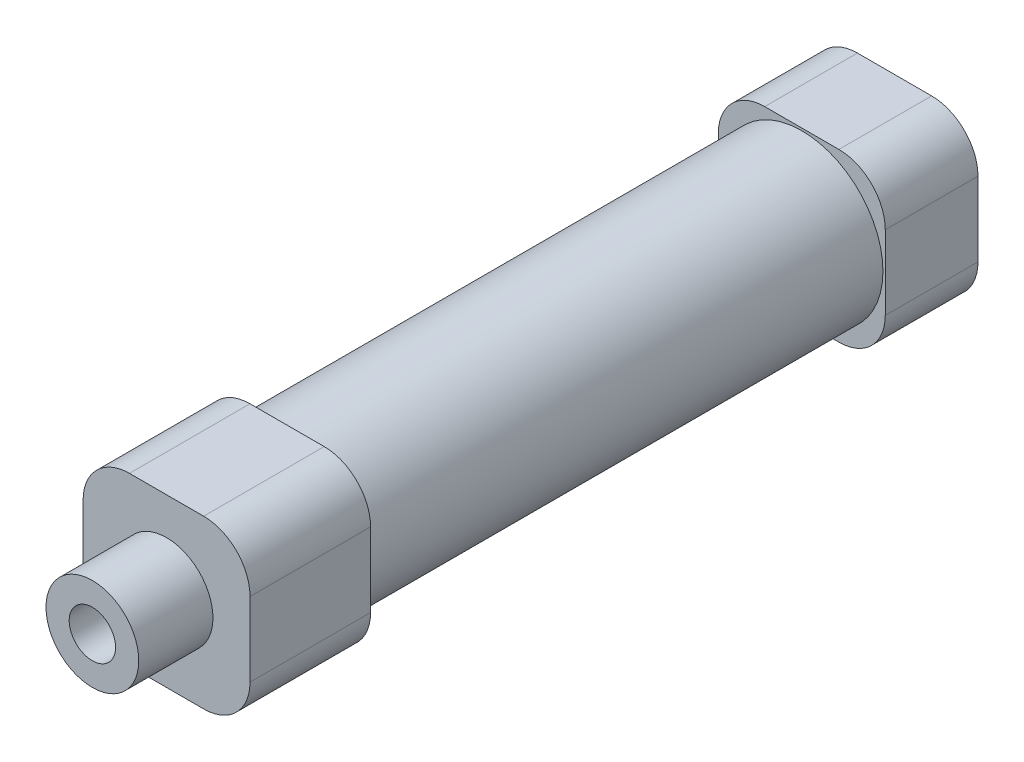
ISO-10303-21;
HEADER;
FILE_DESCRIPTION(('STEP AP214'),'2;1');
FILE_NAME('part.step','',(''),(''),'','','');
FILE_SCHEMA(('AUTOMOTIVE_DESIGN { 1 0 10303 214 1 1 1 1 }'));
ENDSEC;
DATA;
#1=APPLICATION_CONTEXT('core data for automotive mechanical design processes');
#2=APPLICATION_PROTOCOL_DEFINITION('international standard','automotive_design',2000,#1);
#3=PRODUCT_CONTEXT('',#1,'mechanical');
#4=PRODUCT('Part','Part','',(#3));
#5=PRODUCT_RELATED_PRODUCT_CATEGORY('part','',(#4));
#6=PRODUCT_DEFINITION_FORMATION('','',#4);
#7=PRODUCT_DEFINITION_CONTEXT('part definition',#1,'design');
#8=PRODUCT_DEFINITION('design','',#6,#7);
#9=PRODUCT_DEFINITION_SHAPE('','',#8);
#10=(LENGTH_UNIT() NAMED_UNIT(*) SI_UNIT(.MILLI.,.METRE.));
#11=(NAMED_UNIT(*) PLANE_ANGLE_UNIT() SI_UNIT($,.RADIAN.));
#12=(NAMED_UNIT(*) SI_UNIT($,.STERADIAN.) SOLID_ANGLE_UNIT());
#13=UNCERTAINTY_MEASURE_WITH_UNIT(LENGTH_MEASURE(1.E-05),#10,'distance_accuracy_value','');
#14=(GEOMETRIC_REPRESENTATION_CONTEXT(3) GLOBAL_UNCERTAINTY_ASSIGNED_CONTEXT((#13)) GLOBAL_UNIT_ASSIGNED_CONTEXT((#10,
#11,#12)) REPRESENTATION_CONTEXT('',''));
#15=CARTESIAN_POINT('',(0.,0.,0.));
#16=DIRECTION('',(0.,0.,1.));
#17=DIRECTION('',(1.,0.,0.));
#18=AXIS2_PLACEMENT_3D('',#15,#16,#17);
#19=CARTESIAN_POINT('',(0.,0.,78.5));
#20=DIRECTION('',(0.,0.,-1.));
#21=DIRECTION('',(-1.,0.,0.));
#22=AXIS2_PLACEMENT_3D('',#19,#20,#21);
#23=PLANE('',#22);
#24=DIRECTION('',(-1.,0.,0.));
#25=VECTOR('',#24,1.);
#26=CARTESIAN_POINT('',(-9.,9.,78.5));
#27=LINE('',#26,#25);
#28=CARTESIAN_POINT('',(4.,9.,78.5));
#29=VERTEX_POINT('',#28);
#30=CARTESIAN_POINT('',(-4.,9.,78.5));
#31=VERTEX_POINT('',#30);
#32=EDGE_CURVE('E193',#29,#31,#27,.T.);
#33=ORIENTED_EDGE('',*,*,#32,.T.);
#34=CARTESIAN_POINT('',(-4.,4.,78.5));
#35=DIRECTION('',(0.,0.,-1.));
#36=DIRECTION('',(-1.,0.,0.));
#37=AXIS2_PLACEMENT_3D('',#34,#35,#36);
#38=CIRCLE('',#37,5.);
#39=CARTESIAN_POINT('',(-9.,4.,78.5));
#40=VERTEX_POINT('',#39);
#41=EDGE_CURVE('E301',#31,#40,#38,.F.);
#42=ORIENTED_EDGE('',*,*,#41,.T.);
#43=DIRECTION('',(0.,-1.,0.));
#44=VECTOR('',#43,1.);
#45=CARTESIAN_POINT('',(-9.,-9.,78.5));
#46=LINE('',#45,#44);
#47=CARTESIAN_POINT('',(-9.,-4.,78.5));
#48=VERTEX_POINT('',#47);
#49=EDGE_CURVE('E197',#40,#48,#46,.T.);
#50=ORIENTED_EDGE('',*,*,#49,.T.);
#51=CARTESIAN_POINT('',(-4.,-4.,78.5));
#52=DIRECTION('',(0.,0.,-1.));
#53=DIRECTION('',(-1.,0.,0.));
#54=AXIS2_PLACEMENT_3D('',#51,#52,#53);
#55=CIRCLE('',#54,5.);
#56=CARTESIAN_POINT('',(-4.,-9.,78.5));
#57=VERTEX_POINT('',#56);
#58=EDGE_CURVE('E299',#48,#57,#55,.F.);
#59=ORIENTED_EDGE('',*,*,#58,.T.);
#60=DIRECTION('',(1.,0.,0.));
#61=VECTOR('',#60,1.);
#62=CARTESIAN_POINT('',(-9.,-9.,78.5));
#63=LINE('',#62,#61);
#64=CARTESIAN_POINT('',(4.,-9.,78.5));
#65=VERTEX_POINT('',#64);
#66=EDGE_CURVE('E200',#57,#65,#63,.T.);
#67=ORIENTED_EDGE('',*,*,#66,.T.);
#68=CARTESIAN_POINT('',(4.,-4.,78.5));
#69=DIRECTION('',(0.,0.,-1.));
#70=DIRECTION('',(-1.,0.,0.));
#71=AXIS2_PLACEMENT_3D('',#68,#69,#70);
#72=CIRCLE('',#71,5.);
#73=CARTESIAN_POINT('',(9.,-4.,78.5));
#74=VERTEX_POINT('',#73);
#75=EDGE_CURVE('E297',#65,#74,#72,.F.);
#76=ORIENTED_EDGE('',*,*,#75,.T.);
#77=DIRECTION('',(0.,1.,0.));
#78=VECTOR('',#77,1.);
#79=CARTESIAN_POINT('',(9.,-9.,78.5));
#80=LINE('',#79,#78);
#81=CARTESIAN_POINT('',(9.,4.,78.5));
#82=VERTEX_POINT('',#81);
#83=EDGE_CURVE('E190',#74,#82,#80,.T.);
#84=ORIENTED_EDGE('',*,*,#83,.T.);
#85=CARTESIAN_POINT('',(4.,4.,78.5));
#86=DIRECTION('',(0.,0.,-1.));
#87=DIRECTION('',(-1.,0.,0.));
#88=AXIS2_PLACEMENT_3D('',#85,#86,#87);
#89=CIRCLE('',#88,5.);
#90=EDGE_CURVE('E295',#82,#29,#89,.F.);
#91=ORIENTED_EDGE('',*,*,#90,.T.);
#92=EDGE_LOOP('',(#33,#42,#50,#59,#67,#76,#84,#91));
#93=FACE_BOUND('',#92,.T.);
#94=CARTESIAN_POINT('',(0.,0.,78.5));
#95=DIRECTION('',(0.,0.,-1.));
#96=DIRECTION('',(-1.,0.,0.));
#97=AXIS2_PLACEMENT_3D('',#94,#95,#96);
#98=CIRCLE('',#97,5.);
#99=CARTESIAN_POINT('',(-5.,0.,78.5));
#100=VERTEX_POINT('',#99);
#101=EDGE_CURVE('E233',#100,#100,#98,.F.);
#102=ORIENTED_EDGE('',*,*,#101,.F.);
#103=EDGE_LOOP('',(#102));
#104=FACE_BOUND('',#103,.T.);
#105=ADVANCED_FACE('F40',(#93,#104),#23,.F.);
#106=CARTESIAN_POINT('',(0.,0.,10.));
#107=DIRECTION('',(0.,0.,1.));
#108=DIRECTION('',(1.,0.,0.));
#109=AXIS2_PLACEMENT_3D('',#106,#107,#108);
#110=PLANE('',#109);
#111=DIRECTION('',(-1.,0.,0.));
#112=VECTOR('',#111,1.);
#113=CARTESIAN_POINT('',(-9.,9.,10.));
#114=LINE('',#113,#112);
#115=CARTESIAN_POINT('',(4.,9.,10.));
#116=VERTEX_POINT('',#115);
#117=CARTESIAN_POINT('',(-4.,9.,10.));
#118=VERTEX_POINT('',#117);
#119=EDGE_CURVE('E223',#116,#118,#114,.T.);
#120=ORIENTED_EDGE('',*,*,#119,.T.);
#121=CARTESIAN_POINT('',(-4.,4.,10.));
#122=DIRECTION('',(0.,0.,1.));
#123=DIRECTION('',(1.,0.,0.));
#124=AXIS2_PLACEMENT_3D('',#121,#122,#123);
#125=CIRCLE('',#124,5.);
#126=CARTESIAN_POINT('',(-9.,4.,10.));
#127=VERTEX_POINT('',#126);
#128=EDGE_CURVE('E270',#118,#127,#125,.T.);
#129=ORIENTED_EDGE('',*,*,#128,.T.);
#130=DIRECTION('',(0.,-1.,0.));
#131=VECTOR('',#130,1.);
#132=CARTESIAN_POINT('',(-9.,9.,10.));
#133=LINE('',#132,#131);
#134=CARTESIAN_POINT('',(-9.,-4.,10.));
#135=VERTEX_POINT('',#134);
#136=EDGE_CURVE('E227',#127,#135,#133,.T.);
#137=ORIENTED_EDGE('',*,*,#136,.T.);
#138=CARTESIAN_POINT('',(-4.,-4.,10.));
#139=DIRECTION('',(0.,0.,1.));
#140=DIRECTION('',(1.,0.,0.));
#141=AXIS2_PLACEMENT_3D('',#138,#139,#140);
#142=CIRCLE('',#141,5.);
#143=CARTESIAN_POINT('',(-4.,-9.,10.));
#144=VERTEX_POINT('',#143);
#145=EDGE_CURVE('E268',#135,#144,#142,.T.);
#146=ORIENTED_EDGE('',*,*,#145,.T.);
#147=DIRECTION('',(1.,0.,0.));
#148=VECTOR('',#147,1.);
#149=CARTESIAN_POINT('',(-9.,-9.,10.));
#150=LINE('',#149,#148);
#151=CARTESIAN_POINT('',(4.,-9.,10.));
#152=VERTEX_POINT('',#151);
#153=EDGE_CURVE('E230',#144,#152,#150,.T.);
#154=ORIENTED_EDGE('',*,*,#153,.T.);
#155=CARTESIAN_POINT('',(4.,-4.,10.));
#156=DIRECTION('',(0.,0.,1.));
#157=DIRECTION('',(1.,0.,0.));
#158=AXIS2_PLACEMENT_3D('',#155,#156,#157);
#159=CIRCLE('',#158,5.);
#160=CARTESIAN_POINT('',(9.,-4.,10.));
#161=VERTEX_POINT('',#160);
#162=EDGE_CURVE('E266',#152,#161,#159,.T.);
#163=ORIENTED_EDGE('',*,*,#162,.T.);
#164=DIRECTION('',(0.,1.,0.));
#165=VECTOR('',#164,1.);
#166=CARTESIAN_POINT('',(9.,9.,10.));
#167=LINE('',#166,#165);
#168=CARTESIAN_POINT('',(9.,4.,10.));
#169=VERTEX_POINT('',#168);
#170=EDGE_CURVE('E220',#161,#169,#167,.T.);
#171=ORIENTED_EDGE('',*,*,#170,.T.);
#172=CARTESIAN_POINT('',(4.,4.,10.));
#173=DIRECTION('',(0.,0.,1.));
#174=DIRECTION('',(1.,0.,0.));
#175=AXIS2_PLACEMENT_3D('',#172,#173,#174);
#176=CIRCLE('',#175,5.);
#177=EDGE_CURVE('E264',#169,#116,#176,.T.);
#178=ORIENTED_EDGE('',*,*,#177,.T.);
#179=EDGE_LOOP('',(#120,#129,#137,#146,#154,#163,#171,#178));
#180=FACE_BOUND('',#179,.T.);
#181=CARTESIAN_POINT('',(0.,0.,10.));
#182=DIRECTION('',(0.,0.,1.));
#183=DIRECTION('',(1.,0.,0.));
#184=AXIS2_PLACEMENT_3D('',#181,#182,#183);
#185=CIRCLE('',#184,8.75);
#186=CARTESIAN_POINT('',(8.74999999999999,0.,10.));
#187=VERTEX_POINT('',#186);
#188=EDGE_CURVE('E203',#187,#187,#185,.T.);
#189=ORIENTED_EDGE('',*,*,#188,.F.);
#190=EDGE_LOOP('',(#189));
#191=FACE_BOUND('',#190,.T.);
#192=ADVANCED_FACE('F371',(#180,#191),#110,.T.);
#193=CARTESIAN_POINT('',(9.,9.,10.));
#194=DIRECTION('',(-1.,0.,0.));
#195=DIRECTION('',(0.,-1.,0.));
#196=AXIS2_PLACEMENT_3D('',#193,#194,#195);
#197=PLANE('',#196);
#198=ORIENTED_EDGE('',*,*,#170,.F.);
#199=DIRECTION('',(0.,0.,-1.));
#200=VECTOR('',#199,1.);
#201=CARTESIAN_POINT('',(9.,-4.,10.));
#202=LINE('',#201,#200);
#203=CARTESIAN_POINT('',(9.,-4.,0.));
#204=VERTEX_POINT('',#203);
#205=EDGE_CURVE('E310',#161,#204,#202,.T.);
#206=ORIENTED_EDGE('',*,*,#205,.T.);
#207=DIRECTION('',(0.,1.,0.));
#208=VECTOR('',#207,1.);
#209=CARTESIAN_POINT('',(9.,9.,0.));
#210=LINE('',#209,#208);
#211=CARTESIAN_POINT('',(9.,4.,0.));
#212=VERTEX_POINT('',#211);
#213=EDGE_CURVE('E217',#204,#212,#210,.T.);
#214=ORIENTED_EDGE('',*,*,#213,.T.);
#215=DIRECTION('',(0.,0.,-1.));
#216=VECTOR('',#215,1.);
#217=CARTESIAN_POINT('',(9.,4.,10.));
#218=LINE('',#217,#216);
#219=EDGE_CURVE('E308',#212,#169,#218,.F.);
#220=ORIENTED_EDGE('',*,*,#219,.T.);
#221=EDGE_LOOP('',(#198,#206,#214,#220));
#222=FACE_BOUND('',#221,.T.);
#223=ADVANCED_FACE('F376',(#222),#197,.F.);
#224=CARTESIAN_POINT('',(-9.,9.,10.));
#225=DIRECTION('',(0.,-1.,0.));
#226=DIRECTION('',(0.,0.,-1.));
#227=AXIS2_PLACEMENT_3D('',#224,#225,#226);
#228=PLANE('',#227);
#229=DIRECTION('',(-1.,0.,0.));
#230=VECTOR('',#229,1.);
#231=CARTESIAN_POINT('',(-9.,9.,0.));
#232=LINE('',#231,#230);
#233=CARTESIAN_POINT('',(4.,9.,0.));
#234=VERTEX_POINT('',#233);
#235=CARTESIAN_POINT('',(-4.,9.,0.));
#236=VERTEX_POINT('',#235);
#237=EDGE_CURVE('E236',#234,#236,#232,.T.);
#238=ORIENTED_EDGE('',*,*,#237,.T.);
#239=DIRECTION('',(0.,0.,-1.));
#240=VECTOR('',#239,1.);
#241=CARTESIAN_POINT('',(-4.,9.,10.));
#242=LINE('',#241,#240);
#243=EDGE_CURVE('E262',#236,#118,#242,.F.);
#244=ORIENTED_EDGE('',*,*,#243,.T.);
#245=ORIENTED_EDGE('',*,*,#119,.F.);
#246=DIRECTION('',(0.,0.,-1.));
#247=VECTOR('',#246,1.);
#248=CARTESIAN_POINT('',(4.,9.,10.));
#249=LINE('',#248,#247);
#250=EDGE_CURVE('E259',#116,#234,#249,.T.);
#251=ORIENTED_EDGE('',*,*,#250,.T.);
#252=EDGE_LOOP('',(#238,#244,#245,#251));
#253=FACE_BOUND('',#252,.T.);
#254=ADVANCED_FACE('F409',(#253),#228,.F.);
#255=CARTESIAN_POINT('',(-9.,9.,10.));
#256=DIRECTION('',(1.,0.,0.));
#257=DIRECTION('',(0.,1.,0.));
#258=AXIS2_PLACEMENT_3D('',#255,#256,#257);
#259=PLANE('',#258);
#260=ORIENTED_EDGE('',*,*,#136,.F.);
#261=DIRECTION('',(0.,0.,-1.));
#262=VECTOR('',#261,1.);
#263=CARTESIAN_POINT('',(-9.,4.,10.));
#264=LINE('',#263,#262);
#265=CARTESIAN_POINT('',(-9.,4.,0.));
#266=VERTEX_POINT('',#265);
#267=EDGE_CURVE('E248',#127,#266,#264,.T.);
#268=ORIENTED_EDGE('',*,*,#267,.T.);
#269=DIRECTION('',(0.,-1.,0.));
#270=VECTOR('',#269,1.);
#271=CARTESIAN_POINT('',(-9.,9.,0.));
#272=LINE('',#271,#270);
#273=CARTESIAN_POINT('',(-9.,-4.,0.));
#274=VERTEX_POINT('',#273);
#275=EDGE_CURVE('E239',#266,#274,#272,.T.);
#276=ORIENTED_EDGE('',*,*,#275,.T.);
#277=DIRECTION('',(0.,0.,-1.));
#278=VECTOR('',#277,1.);
#279=CARTESIAN_POINT('',(-9.,-4.,10.));
#280=LINE('',#279,#278);
#281=EDGE_CURVE('E246',#274,#135,#280,.F.);
#282=ORIENTED_EDGE('',*,*,#281,.T.);
#283=EDGE_LOOP('',(#260,#268,#276,#282));
#284=FACE_BOUND('',#283,.T.);
#285=ADVANCED_FACE('F405',(#284),#259,.F.);
#286=CARTESIAN_POINT('',(-9.,-9.,10.));
#287=DIRECTION('',(0.,1.,0.));
#288=DIRECTION('',(0.,0.,1.));
#289=AXIS2_PLACEMENT_3D('',#286,#287,#288);
#290=PLANE('',#289);
#291=CARTESIAN_POINT('',(0.,-9.,5.25));
#292=DIRECTION('',(0.,-1.,0.));
#293=DIRECTION('',(0.,0.,-1.));
#294=AXIS2_PLACEMENT_3D('',#291,#292,#293);
#295=CIRCLE('',#294,2.5);
#296=CARTESIAN_POINT('',(0.,-9.,2.75));
#297=VERTEX_POINT('',#296);
#298=EDGE_CURVE('E178',#297,#297,#295,.T.);
#299=ORIENTED_EDGE('',*,*,#298,.F.);
#300=EDGE_LOOP('',(#299));
#301=FACE_BOUND('',#300,.T.);
#302=ORIENTED_EDGE('',*,*,#153,.F.);
#303=DIRECTION('',(0.,0.,-1.));
#304=VECTOR('',#303,1.);
#305=CARTESIAN_POINT('',(-4.,-9.,10.));
#306=LINE('',#305,#304);
#307=CARTESIAN_POINT('',(-4.,-9.,0.));
#308=VERTEX_POINT('',#307);
#309=EDGE_CURVE('E274',#144,#308,#306,.T.);
#310=ORIENTED_EDGE('',*,*,#309,.T.);
#311=DIRECTION('',(1.,0.,0.));
#312=VECTOR('',#311,1.);
#313=CARTESIAN_POINT('',(-9.,-9.,0.));
#314=LINE('',#313,#312);
#315=CARTESIAN_POINT('',(4.,-9.,0.));
#316=VERTEX_POINT('',#315);
#317=EDGE_CURVE('E224',#308,#316,#314,.T.);
#318=ORIENTED_EDGE('',*,*,#317,.T.);
#319=DIRECTION('',(0.,0.,-1.));
#320=VECTOR('',#319,1.);
#321=CARTESIAN_POINT('',(4.,-9.,10.));
#322=LINE('',#321,#320);
#323=EDGE_CURVE('E272',#316,#152,#322,.F.);
#324=ORIENTED_EDGE('',*,*,#323,.T.);
#325=EDGE_LOOP('',(#302,#310,#318,#324));
#326=FACE_BOUND('',#325,.T.);
#327=ADVANCED_FACE('F401',(#301,#326),#290,.F.);
#328=CARTESIAN_POINT('',(0.,0.,0.));
#329=DIRECTION('',(0.,0.,1.));
#330=DIRECTION('',(1.,0.,0.));
#331=AXIS2_PLACEMENT_3D('',#328,#329,#330);
#332=PLANE('',#331);
#333=ORIENTED_EDGE('',*,*,#275,.F.);
#334=CARTESIAN_POINT('',(-4.,4.,0.));
#335=DIRECTION('',(0.,0.,1.));
#336=DIRECTION('',(1.,0.,0.));
#337=AXIS2_PLACEMENT_3D('',#334,#335,#336);
#338=CIRCLE('',#337,5.);
#339=EDGE_CURVE('E257',#266,#236,#338,.F.);
#340=ORIENTED_EDGE('',*,*,#339,.T.);
#341=ORIENTED_EDGE('',*,*,#237,.F.);
#342=CARTESIAN_POINT('',(4.,4.,0.));
#343=DIRECTION('',(0.,0.,1.));
#344=DIRECTION('',(1.,0.,0.));
#345=AXIS2_PLACEMENT_3D('',#342,#343,#344);
#346=CIRCLE('',#345,5.);
#347=EDGE_CURVE('E251',#234,#212,#346,.F.);
#348=ORIENTED_EDGE('',*,*,#347,.T.);
#349=ORIENTED_EDGE('',*,*,#213,.F.);
#350=CARTESIAN_POINT('',(4.,-4.,0.));
#351=DIRECTION('',(0.,0.,1.));
#352=DIRECTION('',(1.,0.,0.));
#353=AXIS2_PLACEMENT_3D('',#350,#351,#352);
#354=CIRCLE('',#353,5.);
#355=EDGE_CURVE('E253',#204,#316,#354,.F.);
#356=ORIENTED_EDGE('',*,*,#355,.T.);
#357=ORIENTED_EDGE('',*,*,#317,.F.);
#358=CARTESIAN_POINT('',(-4.,-4.,0.));
#359=DIRECTION('',(0.,0.,1.));
#360=DIRECTION('',(1.,0.,0.));
#361=AXIS2_PLACEMENT_3D('',#358,#359,#360);
#362=CIRCLE('',#361,5.);
#363=EDGE_CURVE('E255',#308,#274,#362,.F.);
#364=ORIENTED_EDGE('',*,*,#363,.T.);
#365=EDGE_LOOP('',(#333,#340,#341,#348,#349,#356,#357,#364));
#366=FACE_BOUND('',#365,.T.);
#367=ADVANCED_FACE('F396',(#366),#332,.F.);
#368=CARTESIAN_POINT('',(0.,0.,65.5));
#369=DIRECTION('',(0.,0.,-1.));
#370=DIRECTION('',(-1.,0.,0.));
#371=AXIS2_PLACEMENT_3D('',#368,#369,#370);
#372=CYLINDRICAL_SURFACE('',#371,8.75);
#373=CARTESIAN_POINT('',(0.,0.,65.5));
#374=DIRECTION('',(0.,0.,1.));
#375=DIRECTION('',(1.,0.,0.));
#376=AXIS2_PLACEMENT_3D('',#373,#374,#375);
#377=CIRCLE('',#376,8.75);
#378=CARTESIAN_POINT('',(8.74999999999999,0.,65.5));
#379=VERTEX_POINT('',#378);
#380=EDGE_CURVE('E214',#379,#379,#377,.T.);
#381=ORIENTED_EDGE('',*,*,#380,.F.);
#382=EDGE_LOOP('',(#381));
#383=FACE_BOUND('',#382,.T.);
#384=ORIENTED_EDGE('',*,*,#188,.T.);
#385=EDGE_LOOP('',(#384));
#386=FACE_BOUND('',#385,.T.);
#387=ADVANCED_FACE('F385',(#383,#386),#372,.T.);
#388=CARTESIAN_POINT('',(0.,0.,65.5));
#389=DIRECTION('',(0.,0.,-1.));
#390=DIRECTION('',(-1.,0.,0.));
#391=AXIS2_PLACEMENT_3D('',#388,#389,#390);
#392=PLANE('',#391);
#393=DIRECTION('',(0.,-1.,0.));
#394=VECTOR('',#393,1.);
#395=CARTESIAN_POINT('',(-9.,-9.,65.5));
#396=LINE('',#395,#394);
#397=CARTESIAN_POINT('',(-9.,4.,65.5));
#398=VERTEX_POINT('',#397);
#399=CARTESIAN_POINT('',(-9.,-4.,65.5));
#400=VERTEX_POINT('',#399);
#401=EDGE_CURVE('E209',#398,#400,#396,.T.);
#402=ORIENTED_EDGE('',*,*,#401,.F.);
#403=CARTESIAN_POINT('',(-4.,4.,65.5));
#404=DIRECTION('',(0.,0.,-1.));
#405=DIRECTION('',(-1.,0.,0.));
#406=AXIS2_PLACEMENT_3D('',#403,#404,#405);
#407=CIRCLE('',#406,5.);
#408=CARTESIAN_POINT('',(-4.,9.,65.5));
#409=VERTEX_POINT('',#408);
#410=EDGE_CURVE('E288',#398,#409,#407,.T.);
#411=ORIENTED_EDGE('',*,*,#410,.T.);
#412=DIRECTION('',(-1.,0.,0.));
#413=VECTOR('',#412,1.);
#414=CARTESIAN_POINT('',(-9.,9.,65.5));
#415=LINE('',#414,#413);
#416=CARTESIAN_POINT('',(4.,9.,65.5));
#417=VERTEX_POINT('',#416);
#418=EDGE_CURVE('E206',#417,#409,#415,.T.);
#419=ORIENTED_EDGE('',*,*,#418,.F.);
#420=CARTESIAN_POINT('',(4.,4.,65.5));
#421=DIRECTION('',(0.,0.,-1.));
#422=DIRECTION('',(-1.,0.,0.));
#423=AXIS2_PLACEMENT_3D('',#420,#421,#422);
#424=CIRCLE('',#423,5.);
#425=CARTESIAN_POINT('',(9.,4.,65.5));
#426=VERTEX_POINT('',#425);
#427=EDGE_CURVE('E282',#417,#426,#424,.T.);
#428=ORIENTED_EDGE('',*,*,#427,.T.);
#429=DIRECTION('',(0.,1.,0.));
#430=VECTOR('',#429,1.);
#431=CARTESIAN_POINT('',(9.,-9.,65.5));
#432=LINE('',#431,#430);
#433=CARTESIAN_POINT('',(9.,-4.,65.5));
#434=VERTEX_POINT('',#433);
#435=EDGE_CURVE('E189',#434,#426,#432,.T.);
#436=ORIENTED_EDGE('',*,*,#435,.F.);
#437=CARTESIAN_POINT('',(4.,-4.,65.5));
#438=DIRECTION('',(0.,0.,-1.));
#439=DIRECTION('',(-1.,0.,0.));
#440=AXIS2_PLACEMENT_3D('',#437,#438,#439);
#441=CIRCLE('',#440,5.);
#442=CARTESIAN_POINT('',(4.,-9.,65.5));
#443=VERTEX_POINT('',#442);
#444=EDGE_CURVE('E284',#434,#443,#441,.T.);
#445=ORIENTED_EDGE('',*,*,#444,.T.);
#446=DIRECTION('',(1.,0.,0.));
#447=VECTOR('',#446,1.);
#448=CARTESIAN_POINT('',(-9.,-9.,65.5));
#449=LINE('',#448,#447);
#450=CARTESIAN_POINT('',(-4.,-9.,65.5));
#451=VERTEX_POINT('',#450);
#452=EDGE_CURVE('E194',#451,#443,#449,.T.);
#453=ORIENTED_EDGE('',*,*,#452,.F.);
#454=CARTESIAN_POINT('',(-4.,-4.,65.5));
#455=DIRECTION('',(0.,0.,-1.));
#456=DIRECTION('',(-1.,0.,0.));
#457=AXIS2_PLACEMENT_3D('',#454,#455,#456);
#458=CIRCLE('',#457,5.);
#459=EDGE_CURVE('E286',#451,#400,#458,.T.);
#460=ORIENTED_EDGE('',*,*,#459,.T.);
#461=EDGE_LOOP('',(#402,#411,#419,#428,#436,#445,#453,#460));
#462=FACE_BOUND('',#461,.T.);
#463=ORIENTED_EDGE('',*,*,#380,.T.);
#464=EDGE_LOOP('',(#463));
#465=FACE_BOUND('',#464,.T.);
#466=ADVANCED_FACE('F329',(#462,#465),#392,.T.);
#467=CARTESIAN_POINT('',(9.,-9.,78.5));
#468=DIRECTION('',(-1.,0.,0.));
#469=DIRECTION('',(0.,0.,1.));
#470=AXIS2_PLACEMENT_3D('',#467,#468,#469);
#471=PLANE('',#470);
#472=ORIENTED_EDGE('',*,*,#83,.F.);
#473=DIRECTION('',(0.,0.,-1.));
#474=VECTOR('',#473,1.);
#475=CARTESIAN_POINT('',(9.,-4.,78.5));
#476=LINE('',#475,#474);
#477=EDGE_CURVE('E315',#74,#434,#476,.T.);
#478=ORIENTED_EDGE('',*,*,#477,.T.);
#479=ORIENTED_EDGE('',*,*,#435,.T.);
#480=DIRECTION('',(0.,0.,-1.));
#481=VECTOR('',#480,1.);
#482=CARTESIAN_POINT('',(9.,4.,78.5));
#483=LINE('',#482,#481);
#484=EDGE_CURVE('E313',#426,#82,#483,.F.);
#485=ORIENTED_EDGE('',*,*,#484,.T.);
#486=EDGE_LOOP('',(#472,#478,#479,#485));
#487=FACE_BOUND('',#486,.T.);
#488=ADVANCED_FACE('F323',(#487),#471,.F.);
#489=CARTESIAN_POINT('',(-9.,9.,78.5));
#490=DIRECTION('',(0.,-1.,0.));
#491=DIRECTION('',(0.,0.,-1.));
#492=AXIS2_PLACEMENT_3D('',#489,#490,#491);
#493=PLANE('',#492);
#494=ORIENTED_EDGE('',*,*,#418,.T.);
#495=DIRECTION('',(0.,0.,-1.));
#496=VECTOR('',#495,1.);
#497=CARTESIAN_POINT('',(-4.,9.,78.5));
#498=LINE('',#497,#496);
#499=EDGE_CURVE('E293',#409,#31,#498,.F.);
#500=ORIENTED_EDGE('',*,*,#499,.T.);
#501=ORIENTED_EDGE('',*,*,#32,.F.);
#502=DIRECTION('',(0.,0.,-1.));
#503=VECTOR('',#502,1.);
#504=CARTESIAN_POINT('',(4.,9.,78.5));
#505=LINE('',#504,#503);
#506=EDGE_CURVE('E290',#29,#417,#505,.T.);
#507=ORIENTED_EDGE('',*,*,#506,.T.);
#508=EDGE_LOOP('',(#494,#500,#501,#507));
#509=FACE_BOUND('',#508,.T.);
#510=ADVANCED_FACE('F338',(#509),#493,.F.);
#511=CARTESIAN_POINT('',(-9.,-9.,78.5));
#512=DIRECTION('',(1.,0.,0.));
#513=DIRECTION('',(0.,0.,-1.));
#514=AXIS2_PLACEMENT_3D('',#511,#512,#513);
#515=PLANE('',#514);
#516=ORIENTED_EDGE('',*,*,#49,.F.);
#517=DIRECTION('',(0.,0.,-1.));
#518=VECTOR('',#517,1.);
#519=CARTESIAN_POINT('',(-9.,4.,78.5));
#520=LINE('',#519,#518);
#521=EDGE_CURVE('E279',#40,#398,#520,.T.);
#522=ORIENTED_EDGE('',*,*,#521,.T.);
#523=ORIENTED_EDGE('',*,*,#401,.T.);
#524=DIRECTION('',(0.,0.,-1.));
#525=VECTOR('',#524,1.);
#526=CARTESIAN_POINT('',(-9.,-4.,78.5));
#527=LINE('',#526,#525);
#528=EDGE_CURVE('E277',#400,#48,#527,.F.);
#529=ORIENTED_EDGE('',*,*,#528,.T.);
#530=EDGE_LOOP('',(#516,#522,#523,#529));
#531=FACE_BOUND('',#530,.T.);
#532=ADVANCED_FACE('F348',(#531),#515,.F.);
#533=CARTESIAN_POINT('',(-9.,-9.,78.5));
#534=DIRECTION('',(0.,1.,0.));
#535=DIRECTION('',(0.,0.,1.));
#536=AXIS2_PLACEMENT_3D('',#533,#534,#535);
#537=PLANE('',#536);
#538=CARTESIAN_POINT('',(0.,-9.,70.25));
#539=DIRECTION('',(0.,-1.,0.));
#540=DIRECTION('',(0.,0.,-1.));
#541=AXIS2_PLACEMENT_3D('',#538,#539,#540);
#542=CIRCLE('',#541,2.5);
#543=CARTESIAN_POINT('',(0.,-9.,67.75));
#544=VERTEX_POINT('',#543);
#545=EDGE_CURVE('E183',#544,#544,#542,.T.);
#546=ORIENTED_EDGE('',*,*,#545,.F.);
#547=EDGE_LOOP('',(#546));
#548=FACE_BOUND('',#547,.T.);
#549=ORIENTED_EDGE('',*,*,#66,.F.);
#550=DIRECTION('',(0.,0.,-1.));
#551=VECTOR('',#550,1.);
#552=CARTESIAN_POINT('',(-4.,-9.,78.5));
#553=LINE('',#552,#551);
#554=EDGE_CURVE('E305',#57,#451,#553,.T.);
#555=ORIENTED_EDGE('',*,*,#554,.T.);
#556=ORIENTED_EDGE('',*,*,#452,.T.);
#557=DIRECTION('',(0.,0.,-1.));
#558=VECTOR('',#557,1.);
#559=CARTESIAN_POINT('',(4.,-9.,78.5));
#560=LINE('',#559,#558);
#561=EDGE_CURVE('E303',#443,#65,#560,.F.);
#562=ORIENTED_EDGE('',*,*,#561,.T.);
#563=EDGE_LOOP('',(#549,#555,#556,#562));
#564=FACE_BOUND('',#563,.T.);
#565=ADVANCED_FACE('F356',(#548,#564),#537,.F.);
#566=CARTESIAN_POINT('',(0.,0.,86.5));
#567=DIRECTION('',(0.,0.,-1.));
#568=DIRECTION('',(-1.,0.,0.));
#569=AXIS2_PLACEMENT_3D('',#566,#567,#568);
#570=CYLINDRICAL_SURFACE('',#569,5.);
#571=CARTESIAN_POINT('',(0.,0.,86.5));
#572=DIRECTION('',(0.,0.,1.));
#573=DIRECTION('',(1.,0.,0.));
#574=AXIS2_PLACEMENT_3D('',#571,#572,#573);
#575=CIRCLE('',#574,5.);
#576=CARTESIAN_POINT('',(5.,0.,86.5));
#577=VERTEX_POINT('',#576);
#578=EDGE_CURVE('E180',#577,#577,#575,.T.);
#579=ORIENTED_EDGE('',*,*,#578,.F.);
#580=EDGE_LOOP('',(#579));
#581=FACE_BOUND('',#580,.T.);
#582=ORIENTED_EDGE('',*,*,#101,.T.);
#583=EDGE_LOOP('',(#582));
#584=FACE_BOUND('',#583,.T.);
#585=ADVANCED_FACE('F381',(#581,#584),#570,.T.);
#586=CARTESIAN_POINT('',(0.,0.,86.5));
#587=DIRECTION('',(0.,0.,1.));
#588=DIRECTION('',(1.,0.,0.));
#589=AXIS2_PLACEMENT_3D('',#586,#587,#588);
#590=PLANE('',#589);
#591=CARTESIAN_POINT('',(0.,0.,86.5));
#592=DIRECTION('',(0.,0.,1.));
#593=DIRECTION('',(1.,0.,0.));
#594=AXIS2_PLACEMENT_3D('',#591,#592,#593);
#595=CIRCLE('',#594,2.5);
#596=CARTESIAN_POINT('',(2.5,0.,86.5));
#597=VERTEX_POINT('',#596);
#598=EDGE_CURVE('E176',#597,#597,#595,.T.);
#599=ORIENTED_EDGE('',*,*,#598,.F.);
#600=EDGE_LOOP('',(#599));
#601=FACE_BOUND('',#600,.T.);
#602=ORIENTED_EDGE('',*,*,#578,.T.);
#603=EDGE_LOOP('',(#602));
#604=FACE_BOUND('',#603,.T.);
#605=ADVANCED_FACE('F166',(#601,#604),#590,.T.);
#606=CARTESIAN_POINT('',(0.,0.,-7.07106781186548));
#607=DIRECTION('',(0.,0.,1.));
#608=DIRECTION('',(1.,0.,0.));
#609=AXIS2_PLACEMENT_3D('',#606,#607,#608);
#610=CYLINDRICAL_SURFACE('',#609,2.5);
#611=CARTESIAN_POINT('',(0.,0.,70.25));
#612=DIRECTION('',(0.,0.707106781186547,0.707106781186547));
#613=DIRECTION('',(0.,-0.707106781186547,0.707106781186547));
#614=AXIS2_PLACEMENT_3D('',#611,#612,#613);
#615=ELLIPSE('',#614,3.53553390593274,2.5);
#616=CARTESIAN_POINT('',(2.5,0.,70.25));
#617=VERTEX_POINT('',#616);
#618=CARTESIAN_POINT('',(-2.5,0.,70.25));
#619=VERTEX_POINT('',#618);
#620=EDGE_CURVE('E48',#617,#619,#615,.F.);
#621=ORIENTED_EDGE('',*,*,#620,.T.);
#622=CARTESIAN_POINT('',(0.,0.,70.25));
#623=DIRECTION('',(0.,-0.707106781186547,0.707106781186547));
#624=DIRECTION('',(0.,0.707106781186547,0.707106781186547));
#625=AXIS2_PLACEMENT_3D('',#622,#623,#624);
#626=ELLIPSE('',#625,3.53553390593274,2.5);
#627=EDGE_CURVE('E12',#619,#617,#626,.T.);
#628=ORIENTED_EDGE('',*,*,#627,.T.);
#629=EDGE_LOOP('',(#621,#628));
#630=FACE_BOUND('',#629,.T.);
#631=CARTESIAN_POINT('',(0.,0.,5.25));
#632=DIRECTION('',(0.,0.707106781186547,0.707106781186547));
#633=DIRECTION('',(0.,-0.707106781186547,0.707106781186547));
#634=AXIS2_PLACEMENT_3D('',#631,#632,#633);
#635=ELLIPSE('',#634,3.53553390593274,2.5);
#636=CARTESIAN_POINT('',(2.49999999999999,0.,5.25));
#637=VERTEX_POINT('',#636);
#638=CARTESIAN_POINT('',(-2.50000000000001,0.,5.25));
#639=VERTEX_POINT('',#638);
#640=EDGE_CURVE('E169',#637,#639,#635,.F.);
#641=ORIENTED_EDGE('',*,*,#640,.T.);
#642=CARTESIAN_POINT('',(0.,0.,5.25));
#643=DIRECTION('',(0.,-0.707106781186547,0.707106781186547));
#644=DIRECTION('',(0.,0.707106781186547,0.707106781186547));
#645=AXIS2_PLACEMENT_3D('',#642,#643,#644);
#646=ELLIPSE('',#645,3.53553390593274,2.5);
#647=EDGE_CURVE('E59',#639,#637,#646,.T.);
#648=ORIENTED_EDGE('',*,*,#647,.T.);
#649=EDGE_LOOP('',(#641,#648));
#650=FACE_BOUND('',#649,.T.);
#651=CARTESIAN_POINT('',(0.,0.,1.));
#652=DIRECTION('',(0.,0.,1.));
#653=DIRECTION('',(1.,0.,0.));
#654=AXIS2_PLACEMENT_3D('',#651,#652,#653);
#655=CIRCLE('',#654,2.5);
#656=CARTESIAN_POINT('',(2.5,0.,1.));
#657=VERTEX_POINT('',#656);
#658=EDGE_CURVE('E173',#657,#657,#655,.F.);
#659=ORIENTED_EDGE('',*,*,#658,.T.);
#660=EDGE_LOOP('',(#659));
#661=FACE_BOUND('',#660,.T.);
#662=ORIENTED_EDGE('',*,*,#598,.T.);
#663=EDGE_LOOP('',(#662));
#664=FACE_BOUND('',#663,.T.);
#665=ADVANCED_FACE('F162',(#630,#650,#661,#664),#610,.F.);
#666=CARTESIAN_POINT('',(0.,0.,1.));
#667=DIRECTION('',(0.,0.,1.));
#668=DIRECTION('',(1.,0.,0.));
#669=AXIS2_PLACEMENT_3D('',#666,#667,#668);
#670=PLANE('',#669);
#671=ORIENTED_EDGE('',*,*,#658,.F.);
#672=EDGE_LOOP('',(#671));
#673=FACE_BOUND('',#672,.T.);
#674=ADVANCED_FACE('F165',(#673),#670,.T.);
#675=CARTESIAN_POINT('',(-4.,4.,10.));
#676=DIRECTION('',(0.,0.,-1.));
#677=DIRECTION('',(-1.,0.,0.));
#678=AXIS2_PLACEMENT_3D('',#675,#676,#677);
#679=CYLINDRICAL_SURFACE('',#678,5.);
#680=ORIENTED_EDGE('',*,*,#128,.F.);
#681=ORIENTED_EDGE('',*,*,#243,.F.);
#682=ORIENTED_EDGE('',*,*,#339,.F.);
#683=ORIENTED_EDGE('',*,*,#267,.F.);
#684=EDGE_LOOP('',(#680,#681,#682,#683));
#685=FACE_BOUND('',#684,.T.);
#686=ADVANCED_FACE('F417',(#685),#679,.T.);
#687=CARTESIAN_POINT('',(-4.,-4.,10.));
#688=DIRECTION('',(0.,0.,-1.));
#689=DIRECTION('',(-1.,0.,0.));
#690=AXIS2_PLACEMENT_3D('',#687,#688,#689);
#691=CYLINDRICAL_SURFACE('',#690,5.);
#692=ORIENTED_EDGE('',*,*,#145,.F.);
#693=ORIENTED_EDGE('',*,*,#281,.F.);
#694=ORIENTED_EDGE('',*,*,#363,.F.);
#695=ORIENTED_EDGE('',*,*,#309,.F.);
#696=EDGE_LOOP('',(#692,#693,#694,#695));
#697=FACE_BOUND('',#696,.T.);
#698=ADVANCED_FACE('F420',(#697),#691,.T.);
#699=CARTESIAN_POINT('',(-4.,4.,78.5));
#700=DIRECTION('',(0.,0.,-1.));
#701=DIRECTION('',(-1.,0.,0.));
#702=AXIS2_PLACEMENT_3D('',#699,#700,#701);
#703=CYLINDRICAL_SURFACE('',#702,5.);
#704=ORIENTED_EDGE('',*,*,#41,.F.);
#705=ORIENTED_EDGE('',*,*,#499,.F.);
#706=ORIENTED_EDGE('',*,*,#410,.F.);
#707=ORIENTED_EDGE('',*,*,#521,.F.);
#708=EDGE_LOOP('',(#704,#705,#706,#707));
#709=FACE_BOUND('',#708,.T.);
#710=ADVANCED_FACE('F346',(#709),#703,.T.);
#711=CARTESIAN_POINT('',(-4.,-4.,78.5));
#712=DIRECTION('',(0.,0.,-1.));
#713=DIRECTION('',(-1.,0.,0.));
#714=AXIS2_PLACEMENT_3D('',#711,#712,#713);
#715=CYLINDRICAL_SURFACE('',#714,5.);
#716=ORIENTED_EDGE('',*,*,#58,.F.);
#717=ORIENTED_EDGE('',*,*,#528,.F.);
#718=ORIENTED_EDGE('',*,*,#459,.F.);
#719=ORIENTED_EDGE('',*,*,#554,.F.);
#720=EDGE_LOOP('',(#716,#717,#718,#719));
#721=FACE_BOUND('',#720,.T.);
#722=ADVANCED_FACE('F353',(#721),#715,.T.);
#723=CARTESIAN_POINT('',(4.,-4.,10.));
#724=DIRECTION('',(0.,0.,-1.));
#725=DIRECTION('',(-1.,0.,0.));
#726=AXIS2_PLACEMENT_3D('',#723,#724,#725);
#727=CYLINDRICAL_SURFACE('',#726,5.);
#728=ORIENTED_EDGE('',*,*,#162,.F.);
#729=ORIENTED_EDGE('',*,*,#323,.F.);
#730=ORIENTED_EDGE('',*,*,#355,.F.);
#731=ORIENTED_EDGE('',*,*,#205,.F.);
#732=EDGE_LOOP('',(#728,#729,#730,#731));
#733=FACE_BOUND('',#732,.T.);
#734=ADVANCED_FACE('F361',(#733),#727,.T.);
#735=CARTESIAN_POINT('',(4.,-4.,78.5));
#736=DIRECTION('',(0.,0.,-1.));
#737=DIRECTION('',(-1.,0.,0.));
#738=AXIS2_PLACEMENT_3D('',#735,#736,#737);
#739=CYLINDRICAL_SURFACE('',#738,5.);
#740=ORIENTED_EDGE('',*,*,#75,.F.);
#741=ORIENTED_EDGE('',*,*,#561,.F.);
#742=ORIENTED_EDGE('',*,*,#444,.F.);
#743=ORIENTED_EDGE('',*,*,#477,.F.);
#744=EDGE_LOOP('',(#740,#741,#742,#743));
#745=FACE_BOUND('',#744,.T.);
#746=ADVANCED_FACE('F358',(#745),#739,.T.);
#747=CARTESIAN_POINT('',(4.,4.,10.));
#748=DIRECTION('',(0.,0.,-1.));
#749=DIRECTION('',(-1.,0.,0.));
#750=AXIS2_PLACEMENT_3D('',#747,#748,#749);
#751=CYLINDRICAL_SURFACE('',#750,5.);
#752=ORIENTED_EDGE('',*,*,#177,.F.);
#753=ORIENTED_EDGE('',*,*,#219,.F.);
#754=ORIENTED_EDGE('',*,*,#347,.F.);
#755=ORIENTED_EDGE('',*,*,#250,.F.);
#756=EDGE_LOOP('',(#752,#753,#754,#755));
#757=FACE_BOUND('',#756,.T.);
#758=ADVANCED_FACE('F360',(#757),#751,.T.);
#759=CARTESIAN_POINT('',(4.,4.,78.5));
#760=DIRECTION('',(0.,0.,-1.));
#761=DIRECTION('',(-1.,0.,0.));
#762=AXIS2_PLACEMENT_3D('',#759,#760,#761);
#763=CYLINDRICAL_SURFACE('',#762,5.);
#764=ORIENTED_EDGE('',*,*,#90,.F.);
#765=ORIENTED_EDGE('',*,*,#484,.F.);
#766=ORIENTED_EDGE('',*,*,#427,.F.);
#767=ORIENTED_EDGE('',*,*,#506,.F.);
#768=EDGE_LOOP('',(#764,#765,#766,#767));
#769=FACE_BOUND('',#768,.T.);
#770=ADVANCED_FACE('F42',(#769),#763,.T.);
#771=CARTESIAN_POINT('',(0.,7.07106781186548,5.25));
#772=DIRECTION('',(0.,-1.,0.));
#773=DIRECTION('',(0.,0.,-1.));
#774=AXIS2_PLACEMENT_3D('',#771,#772,#773);
#775=CYLINDRICAL_SURFACE('',#774,2.5);
#776=ORIENTED_EDGE('',*,*,#298,.T.);
#777=EDGE_LOOP('',(#776));
#778=FACE_BOUND('',#777,.T.);
#779=ORIENTED_EDGE('',*,*,#640,.F.);
#780=ORIENTED_EDGE('',*,*,#647,.F.);
#781=EDGE_LOOP('',(#779,#780));
#782=FACE_BOUND('',#781,.T.);
#783=ADVANCED_FACE('F455',(#778,#782),#775,.F.);
#784=CARTESIAN_POINT('',(0.,7.07106781186548,70.25));
#785=DIRECTION('',(0.,-1.,0.));
#786=DIRECTION('',(0.,0.,-1.));
#787=AXIS2_PLACEMENT_3D('',#784,#785,#786);
#788=CYLINDRICAL_SURFACE('',#787,2.5);
#789=ORIENTED_EDGE('',*,*,#545,.T.);
#790=EDGE_LOOP('',(#789));
#791=FACE_BOUND('',#790,.T.);
#792=ORIENTED_EDGE('',*,*,#620,.F.);
#793=ORIENTED_EDGE('',*,*,#627,.F.);
#794=EDGE_LOOP('',(#792,#793));
#795=FACE_BOUND('',#794,.T.);
#796=ADVANCED_FACE('F160',(#791,#795),#788,.F.);
#797=CLOSED_SHELL('',(#105,#192,#223,#254,#285,#327,#367,#387,#466,#488,#510,#532,#565,#585,
#605,#665,#674,#686,#698,#710,#722,#734,#746,#758,#770,#783,#796));
#798=MANIFOLD_SOLID_BREP('B2',#797);
#799=ADVANCED_BREP_SHAPE_REPRESENTATION('',(#18,#798),#14);
#800=SHAPE_DEFINITION_REPRESENTATION(#9,#799);
ENDSEC;
END-ISO-10303-21;
